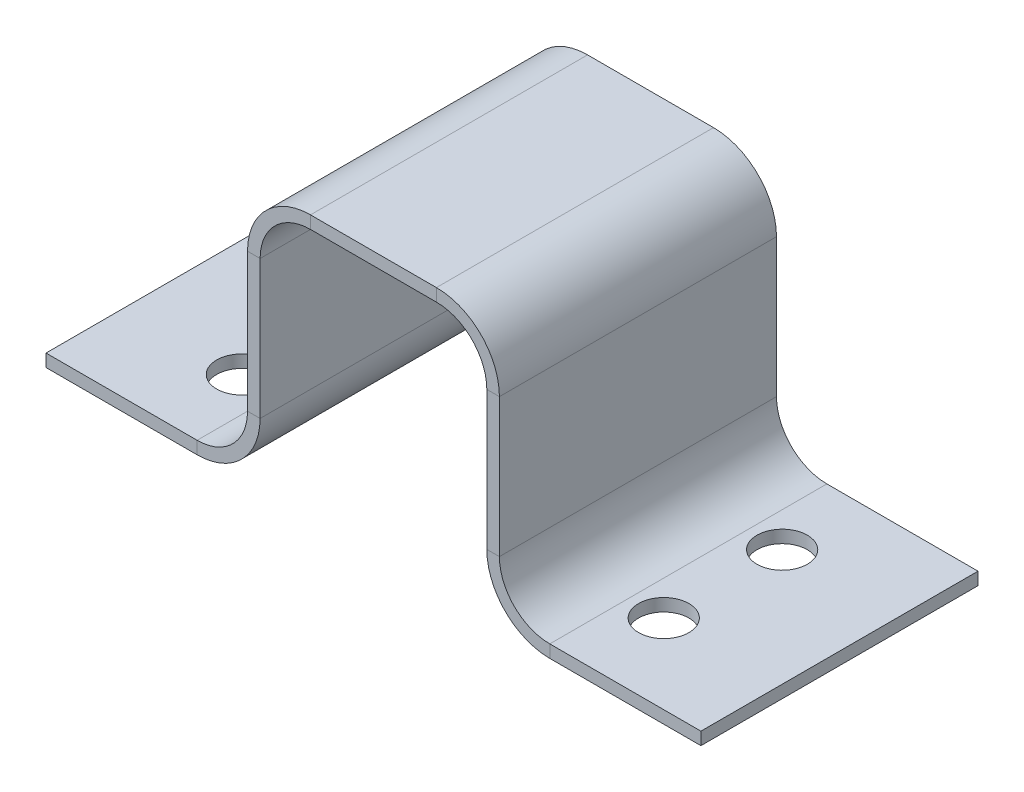
ISO-10303-21;
HEADER;
FILE_DESCRIPTION(('STEP AP214'),'2;1');
FILE_NAME('part.step','',(''),(''),'','','');
FILE_SCHEMA(('AUTOMOTIVE_DESIGN { 1 0 10303 214 1 1 1 1 }'));
ENDSEC;
DATA;
#1=APPLICATION_CONTEXT('core data for automotive mechanical design processes');
#2=APPLICATION_PROTOCOL_DEFINITION('international standard','automotive_design',2000,#1);
#3=PRODUCT_CONTEXT('',#1,'mechanical');
#4=PRODUCT('Part','Part','',(#3));
#5=PRODUCT_RELATED_PRODUCT_CATEGORY('part','',(#4));
#6=PRODUCT_DEFINITION_FORMATION('','',#4);
#7=PRODUCT_DEFINITION_CONTEXT('part definition',#1,'design');
#8=PRODUCT_DEFINITION('design','',#6,#7);
#9=PRODUCT_DEFINITION_SHAPE('','',#8);
#10=(LENGTH_UNIT() NAMED_UNIT(*) SI_UNIT(.MILLI.,.METRE.));
#11=(NAMED_UNIT(*) PLANE_ANGLE_UNIT() SI_UNIT($,.RADIAN.));
#12=(NAMED_UNIT(*) SI_UNIT($,.STERADIAN.) SOLID_ANGLE_UNIT());
#13=UNCERTAINTY_MEASURE_WITH_UNIT(LENGTH_MEASURE(1.E-05),#10,'distance_accuracy_value','');
#14=(GEOMETRIC_REPRESENTATION_CONTEXT(3) GLOBAL_UNCERTAINTY_ASSIGNED_CONTEXT((#13)) GLOBAL_UNIT_ASSIGNED_CONTEXT((#10,
#11,#12)) REPRESENTATION_CONTEXT('',''));
#15=CARTESIAN_POINT('',(0.,0.,0.));
#16=DIRECTION('',(0.,0.,1.));
#17=DIRECTION('',(1.,0.,0.));
#18=AXIS2_PLACEMENT_3D('',#15,#16,#17);
#19=CARTESIAN_POINT('',(-41.275,1.5875,17.4625));
#20=DIRECTION('',(-1.,0.,0.));
#21=DIRECTION('',(0.,0.,-1.));
#22=AXIS2_PLACEMENT_3D('',#19,#20,#21);
#23=PLANE('',#22);
#24=DIRECTION('',(0.,1.,0.));
#25=VECTOR('',#24,1.);
#26=CARTESIAN_POINT('',(-41.275,1.5875,-17.4625));
#27=LINE('',#26,#25);
#28=CARTESIAN_POINT('',(-41.275,0.,-17.4625));
#29=VERTEX_POINT('',#28);
#30=CARTESIAN_POINT('',(-41.275,1.5875,-17.4625));
#31=VERTEX_POINT('',#30);
#32=EDGE_CURVE('E11',#29,#31,#27,.T.);
#33=ORIENTED_EDGE('',*,*,#32,.F.);
#34=DIRECTION('',(0.,0.,-1.));
#35=VECTOR('',#34,1.);
#36=CARTESIAN_POINT('',(-41.275,0.,17.4625));
#37=LINE('',#36,#35);
#38=CARTESIAN_POINT('',(-41.275,0.,17.4625));
#39=VERTEX_POINT('',#38);
#40=EDGE_CURVE('E125',#39,#29,#37,.T.);
#41=ORIENTED_EDGE('',*,*,#40,.F.);
#42=DIRECTION('',(0.,1.,0.));
#43=VECTOR('',#42,1.);
#44=CARTESIAN_POINT('',(-41.275,1.5875,17.4625));
#45=LINE('',#44,#43);
#46=CARTESIAN_POINT('',(-41.275,1.5875,17.4625));
#47=VERTEX_POINT('',#46);
#48=EDGE_CURVE('E51',#39,#47,#45,.T.);
#49=ORIENTED_EDGE('',*,*,#48,.T.);
#50=DIRECTION('',(0.,0.,-1.));
#51=VECTOR('',#50,1.);
#52=CARTESIAN_POINT('',(-41.275,1.5875,17.4625));
#53=LINE('',#52,#51);
#54=EDGE_CURVE('E128',#47,#31,#53,.T.);
#55=ORIENTED_EDGE('',*,*,#54,.T.);
#56=EDGE_LOOP('',(#33,#41,#49,#55));
#57=FACE_BOUND('',#56,.T.);
#58=ADVANCED_FACE('F41',(#57),#23,.T.);
#59=CARTESIAN_POINT('',(-41.275,1.5875,17.4625));
#60=DIRECTION('',(0.,0.,1.));
#61=DIRECTION('',(-1.,0.,0.));
#62=AXIS2_PLACEMENT_3D('',#59,#60,#61);
#63=PLANE('',#62);
#64=ORIENTED_EDGE('',*,*,#48,.F.);
#65=DIRECTION('',(1.,0.,0.));
#66=VECTOR('',#65,1.);
#67=CARTESIAN_POINT('',(-41.275,0.,17.4625));
#68=LINE('',#67,#66);
#69=CARTESIAN_POINT('',(-22.225,0.,17.4625));
#70=VERTEX_POINT('',#69);
#71=EDGE_CURVE('E140',#70,#39,#68,.F.);
#72=ORIENTED_EDGE('',*,*,#71,.F.);
#73=DIRECTION('',(0.,1.,0.));
#74=VECTOR('',#73,1.);
#75=CARTESIAN_POINT('',(-22.225,1.5875,17.4625));
#76=LINE('',#75,#74);
#77=CARTESIAN_POINT('',(-22.225,1.5875,17.4625));
#78=VERTEX_POINT('',#77);
#79=EDGE_CURVE('E210',#70,#78,#76,.T.);
#80=ORIENTED_EDGE('',*,*,#79,.T.);
#81=DIRECTION('',(-1.,0.,0.));
#82=VECTOR('',#81,1.);
#83=CARTESIAN_POINT('',(-41.275,1.5875,17.4625));
#84=LINE('',#83,#82);
#85=EDGE_CURVE('E218',#78,#47,#84,.T.);
#86=ORIENTED_EDGE('',*,*,#85,.T.);
#87=EDGE_LOOP('',(#64,#72,#80,#86));
#88=FACE_BOUND('',#87,.T.);
#89=ADVANCED_FACE('F222',(#88),#63,.T.);
#90=CARTESIAN_POINT('',(-22.225,7.93749999999999,17.4625));
#91=DIRECTION('',(0.,0.,1.));
#92=DIRECTION('',(1.,0.,0.));
#93=AXIS2_PLACEMENT_3D('',#90,#91,#92);
#94=PLANE('',#93);
#95=ORIENTED_EDGE('',*,*,#79,.F.);
#96=CARTESIAN_POINT('',(-22.225,7.93749999999999,17.4625));
#97=DIRECTION('',(0.,0.,-1.));
#98=DIRECTION('',(-1.,0.,0.));
#99=AXIS2_PLACEMENT_3D('',#96,#97,#98);
#100=CIRCLE('',#99,7.9375);
#101=CARTESIAN_POINT('',(-14.2875,7.93749999999999,17.4625));
#102=VERTEX_POINT('',#101);
#103=EDGE_CURVE('E266',#102,#70,#100,.T.);
#104=ORIENTED_EDGE('',*,*,#103,.F.);
#105=DIRECTION('',(-1.,0.,0.));
#106=VECTOR('',#105,1.);
#107=CARTESIAN_POINT('',(-15.875,7.93749999999999,17.4625));
#108=LINE('',#107,#106);
#109=CARTESIAN_POINT('',(-15.875,7.93749999999999,17.4625));
#110=VERTEX_POINT('',#109);
#111=EDGE_CURVE('E207',#102,#110,#108,.T.);
#112=ORIENTED_EDGE('',*,*,#111,.T.);
#113=CARTESIAN_POINT('',(-22.225,7.93749999999999,17.4625));
#114=DIRECTION('',(0.,0.,-1.));
#115=DIRECTION('',(1.,0.,0.));
#116=AXIS2_PLACEMENT_3D('',#113,#114,#115);
#117=CIRCLE('',#116,6.35);
#118=EDGE_CURVE('E230',#110,#78,#117,.T.);
#119=ORIENTED_EDGE('',*,*,#118,.T.);
#120=EDGE_LOOP('',(#95,#104,#112,#119));
#121=FACE_BOUND('',#120,.T.);
#122=ADVANCED_FACE('F412',(#121),#94,.T.);
#123=CARTESIAN_POINT('',(-15.875,7.93749999999999,17.4625));
#124=DIRECTION('',(0.,0.,1.));
#125=DIRECTION('',(0.,-1.,0.));
#126=AXIS2_PLACEMENT_3D('',#123,#124,#125);
#127=PLANE('',#126);
#128=ORIENTED_EDGE('',*,*,#111,.F.);
#129=DIRECTION('',(0.,1.,0.));
#130=VECTOR('',#129,1.);
#131=CARTESIAN_POINT('',(-14.2875,7.93749999999999,17.4625));
#132=LINE('',#131,#130);
#133=CARTESIAN_POINT('',(-14.2875,25.4,17.4625));
#134=VERTEX_POINT('',#133);
#135=EDGE_CURVE('E238',#134,#102,#132,.F.);
#136=ORIENTED_EDGE('',*,*,#135,.F.);
#137=DIRECTION('',(-1.,0.,0.));
#138=VECTOR('',#137,1.);
#139=CARTESIAN_POINT('',(-15.875,25.4,17.4625));
#140=LINE('',#139,#138);
#141=CARTESIAN_POINT('',(-15.875,25.4,17.4625));
#142=VERTEX_POINT('',#141);
#143=EDGE_CURVE('E204',#134,#142,#140,.T.);
#144=ORIENTED_EDGE('',*,*,#143,.T.);
#145=DIRECTION('',(0.,-1.,0.));
#146=VECTOR('',#145,1.);
#147=CARTESIAN_POINT('',(-15.875,7.93749999999999,17.4625));
#148=LINE('',#147,#146);
#149=EDGE_CURVE('E346',#142,#110,#148,.T.);
#150=ORIENTED_EDGE('',*,*,#149,.T.);
#151=EDGE_LOOP('',(#128,#136,#144,#150));
#152=FACE_BOUND('',#151,.T.);
#153=ADVANCED_FACE('F545',(#152),#127,.T.);
#154=CARTESIAN_POINT('',(-7.93749999999999,25.4,17.4625));
#155=DIRECTION('',(0.,0.,-1.));
#156=DIRECTION('',(-1.,0.,0.));
#157=AXIS2_PLACEMENT_3D('',#154,#155,#156);
#158=PLANE('',#157);
#159=ORIENTED_EDGE('',*,*,#143,.F.);
#160=CARTESIAN_POINT('',(-7.93749999999999,25.4,17.4625));
#161=DIRECTION('',(0.,0.,-1.));
#162=DIRECTION('',(-1.,0.,0.));
#163=AXIS2_PLACEMENT_3D('',#160,#161,#162);
#164=CIRCLE('',#163,6.35);
#165=CARTESIAN_POINT('',(-7.93749999999999,31.75,17.4625));
#166=VERTEX_POINT('',#165);
#167=EDGE_CURVE('E158',#166,#134,#164,.F.);
#168=ORIENTED_EDGE('',*,*,#167,.F.);
#169=DIRECTION('',(0.,1.,0.));
#170=VECTOR('',#169,1.);
#171=CARTESIAN_POINT('',(-7.93749999999999,33.3375,17.4625));
#172=LINE('',#171,#170);
#173=CARTESIAN_POINT('',(-7.93749999999999,33.3375,17.4625));
#174=VERTEX_POINT('',#173);
#175=EDGE_CURVE('E201',#166,#174,#172,.T.);
#176=ORIENTED_EDGE('',*,*,#175,.T.);
#177=CARTESIAN_POINT('',(-7.93749999999999,25.4,17.4625));
#178=DIRECTION('',(0.,0.,1.));
#179=DIRECTION('',(-1.,0.,0.));
#180=AXIS2_PLACEMENT_3D('',#177,#178,#179);
#181=CIRCLE('',#180,7.9375);
#182=EDGE_CURVE('E355',#174,#142,#181,.T.);
#183=ORIENTED_EDGE('',*,*,#182,.T.);
#184=EDGE_LOOP('',(#159,#168,#176,#183));
#185=FACE_BOUND('',#184,.T.);
#186=ADVANCED_FACE('F542',(#185),#158,.F.);
#187=CARTESIAN_POINT('',(-7.93749999999999,33.3375,17.4625));
#188=DIRECTION('',(0.,0.,1.));
#189=DIRECTION('',(-1.,0.,0.));
#190=AXIS2_PLACEMENT_3D('',#187,#188,#189);
#191=PLANE('',#190);
#192=ORIENTED_EDGE('',*,*,#175,.F.);
#193=DIRECTION('',(1.,0.,0.));
#194=VECTOR('',#193,1.);
#195=CARTESIAN_POINT('',(-7.93749999999999,31.75,17.4625));
#196=LINE('',#195,#194);
#197=CARTESIAN_POINT('',(7.9375,31.75,17.4625));
#198=VERTEX_POINT('',#197);
#199=EDGE_CURVE('E247',#198,#166,#196,.F.);
#200=ORIENTED_EDGE('',*,*,#199,.F.);
#201=DIRECTION('',(0.,1.,0.));
#202=VECTOR('',#201,1.);
#203=CARTESIAN_POINT('',(7.9375,33.3375,17.4625));
#204=LINE('',#203,#202);
#205=CARTESIAN_POINT('',(7.9375,33.3375,17.4625));
#206=VERTEX_POINT('',#205);
#207=EDGE_CURVE('E198',#198,#206,#204,.T.);
#208=ORIENTED_EDGE('',*,*,#207,.T.);
#209=DIRECTION('',(-1.,0.,0.));
#210=VECTOR('',#209,1.);
#211=CARTESIAN_POINT('',(-7.93749999999999,33.3375,17.4625));
#212=LINE('',#211,#210);
#213=EDGE_CURVE('E315',#206,#174,#212,.T.);
#214=ORIENTED_EDGE('',*,*,#213,.T.);
#215=EDGE_LOOP('',(#192,#200,#208,#214));
#216=FACE_BOUND('',#215,.T.);
#217=ADVANCED_FACE('F540',(#216),#191,.T.);
#218=CARTESIAN_POINT('',(7.9375,25.4,17.4625));
#219=DIRECTION('',(0.,0.,-1.));
#220=DIRECTION('',(-1.,0.,0.));
#221=AXIS2_PLACEMENT_3D('',#218,#219,#220);
#222=PLANE('',#221);
#223=ORIENTED_EDGE('',*,*,#207,.F.);
#224=CARTESIAN_POINT('',(7.9375,25.4,17.4625));
#225=DIRECTION('',(0.,0.,-1.));
#226=DIRECTION('',(-1.,0.,0.));
#227=AXIS2_PLACEMENT_3D('',#224,#225,#226);
#228=CIRCLE('',#227,6.35);
#229=CARTESIAN_POINT('',(14.2875,25.4,17.4625));
#230=VERTEX_POINT('',#229);
#231=EDGE_CURVE('E269',#230,#198,#228,.F.);
#232=ORIENTED_EDGE('',*,*,#231,.F.);
#233=DIRECTION('',(1.,0.,0.));
#234=VECTOR('',#233,1.);
#235=CARTESIAN_POINT('',(15.875,25.4,17.4625));
#236=LINE('',#235,#234);
#237=CARTESIAN_POINT('',(15.875,25.4,17.4625));
#238=VERTEX_POINT('',#237);
#239=EDGE_CURVE('E195',#230,#238,#236,.T.);
#240=ORIENTED_EDGE('',*,*,#239,.T.);
#241=CARTESIAN_POINT('',(7.9375,25.4,17.4625));
#242=DIRECTION('',(0.,0.,1.));
#243=DIRECTION('',(-1.,0.,0.));
#244=AXIS2_PLACEMENT_3D('',#241,#242,#243);
#245=CIRCLE('',#244,7.9375);
#246=EDGE_CURVE('E337',#238,#206,#245,.T.);
#247=ORIENTED_EDGE('',*,*,#246,.T.);
#248=EDGE_LOOP('',(#223,#232,#240,#247));
#249=FACE_BOUND('',#248,.T.);
#250=ADVANCED_FACE('F528',(#249),#222,.F.);
#251=CARTESIAN_POINT('',(15.875,25.4,17.4625));
#252=DIRECTION('',(0.,0.,1.));
#253=DIRECTION('',(0.,1.,0.));
#254=AXIS2_PLACEMENT_3D('',#251,#252,#253);
#255=PLANE('',#254);
#256=ORIENTED_EDGE('',*,*,#239,.F.);
#257=DIRECTION('',(0.,-1.,0.));
#258=VECTOR('',#257,1.);
#259=CARTESIAN_POINT('',(14.2875,25.4,17.4625));
#260=LINE('',#259,#258);
#261=CARTESIAN_POINT('',(14.2875,7.9375,17.4625));
#262=VERTEX_POINT('',#261);
#263=EDGE_CURVE('E256',#262,#230,#260,.F.);
#264=ORIENTED_EDGE('',*,*,#263,.F.);
#265=DIRECTION('',(1.,0.,0.));
#266=VECTOR('',#265,1.);
#267=CARTESIAN_POINT('',(15.875,7.9375,17.4625));
#268=LINE('',#267,#266);
#269=CARTESIAN_POINT('',(15.875,7.9375,17.4625));
#270=VERTEX_POINT('',#269);
#271=EDGE_CURVE('E192',#262,#270,#268,.T.);
#272=ORIENTED_EDGE('',*,*,#271,.T.);
#273=DIRECTION('',(0.,1.,0.));
#274=VECTOR('',#273,1.);
#275=CARTESIAN_POINT('',(15.875,25.4,17.4625));
#276=LINE('',#275,#274);
#277=EDGE_CURVE('E328',#270,#238,#276,.T.);
#278=ORIENTED_EDGE('',*,*,#277,.T.);
#279=EDGE_LOOP('',(#256,#264,#272,#278));
#280=FACE_BOUND('',#279,.T.);
#281=ADVANCED_FACE('F605',(#280),#255,.T.);
#282=CARTESIAN_POINT('',(22.225,7.9375,17.4625));
#283=DIRECTION('',(0.,0.,1.));
#284=DIRECTION('',(1.,0.,0.));
#285=AXIS2_PLACEMENT_3D('',#282,#283,#284);
#286=PLANE('',#285);
#287=ORIENTED_EDGE('',*,*,#271,.F.);
#288=CARTESIAN_POINT('',(22.225,7.9375,17.4625));
#289=DIRECTION('',(0.,0.,-1.));
#290=DIRECTION('',(-1.,0.,0.));
#291=AXIS2_PLACEMENT_3D('',#288,#289,#290);
#292=CIRCLE('',#291,7.9375);
#293=CARTESIAN_POINT('',(22.225,0.,17.4625));
#294=VERTEX_POINT('',#293);
#295=EDGE_CURVE('E152',#294,#262,#292,.T.);
#296=ORIENTED_EDGE('',*,*,#295,.F.);
#297=DIRECTION('',(0.,1.,0.));
#298=VECTOR('',#297,1.);
#299=CARTESIAN_POINT('',(22.225,1.5875,17.4625));
#300=LINE('',#299,#298);
#301=CARTESIAN_POINT('',(22.225,1.5875,17.4625));
#302=VERTEX_POINT('',#301);
#303=EDGE_CURVE('E189',#294,#302,#300,.T.);
#304=ORIENTED_EDGE('',*,*,#303,.T.);
#305=CARTESIAN_POINT('',(22.225,7.9375,17.4625));
#306=DIRECTION('',(0.,0.,-1.));
#307=DIRECTION('',(1.,0.,0.));
#308=AXIS2_PLACEMENT_3D('',#305,#306,#307);
#309=CIRCLE('',#308,6.35);
#310=EDGE_CURVE('E379',#302,#270,#309,.T.);
#311=ORIENTED_EDGE('',*,*,#310,.T.);
#312=EDGE_LOOP('',(#287,#296,#304,#311));
#313=FACE_BOUND('',#312,.T.);
#314=ADVANCED_FACE('F602',(#313),#286,.T.);
#315=CARTESIAN_POINT('',(22.225,1.5875,17.4625));
#316=DIRECTION('',(0.,0.,1.));
#317=DIRECTION('',(-1.,0.,0.));
#318=AXIS2_PLACEMENT_3D('',#315,#316,#317);
#319=PLANE('',#318);
#320=ORIENTED_EDGE('',*,*,#303,.F.);
#321=DIRECTION('',(1.,0.,0.));
#322=VECTOR('',#321,1.);
#323=CARTESIAN_POINT('',(22.225,0.,17.4625));
#324=LINE('',#323,#322);
#325=CARTESIAN_POINT('',(41.275,0.,17.4625));
#326=VERTEX_POINT('',#325);
#327=EDGE_CURVE('E264',#326,#294,#324,.F.);
#328=ORIENTED_EDGE('',*,*,#327,.F.);
#329=DIRECTION('',(0.,1.,0.));
#330=VECTOR('',#329,1.);
#331=CARTESIAN_POINT('',(41.275,1.5875,17.4625));
#332=LINE('',#331,#330);
#333=CARTESIAN_POINT('',(41.275,1.5875,17.4625));
#334=VERTEX_POINT('',#333);
#335=EDGE_CURVE('E186',#326,#334,#332,.T.);
#336=ORIENTED_EDGE('',*,*,#335,.T.);
#337=DIRECTION('',(-1.,0.,0.));
#338=VECTOR('',#337,1.);
#339=CARTESIAN_POINT('',(22.225,1.5875,17.4625));
#340=LINE('',#339,#338);
#341=EDGE_CURVE('E370',#334,#302,#340,.T.);
#342=ORIENTED_EDGE('',*,*,#341,.T.);
#343=EDGE_LOOP('',(#320,#328,#336,#342));
#344=FACE_BOUND('',#343,.T.);
#345=ADVANCED_FACE('F459',(#344),#319,.T.);
#346=CARTESIAN_POINT('',(41.275,1.5875,17.4625));
#347=DIRECTION('',(-1.,0.,0.));
#348=DIRECTION('',(0.,0.,-1.));
#349=AXIS2_PLACEMENT_3D('',#346,#347,#348);
#350=PLANE('',#349);
#351=ORIENTED_EDGE('',*,*,#335,.F.);
#352=DIRECTION('',(0.,0.,1.));
#353=VECTOR('',#352,1.);
#354=CARTESIAN_POINT('',(41.275,0.,17.4625));
#355=LINE('',#354,#353);
#356=CARTESIAN_POINT('',(41.275,0.,-17.4625));
#357=VERTEX_POINT('',#356);
#358=EDGE_CURVE('E281',#326,#357,#355,.F.);
#359=ORIENTED_EDGE('',*,*,#358,.T.);
#360=DIRECTION('',(0.,1.,0.));
#361=VECTOR('',#360,1.);
#362=CARTESIAN_POINT('',(41.275,1.5875,-17.4625));
#363=LINE('',#362,#361);
#364=CARTESIAN_POINT('',(41.275,1.5875,-17.4625));
#365=VERTEX_POINT('',#364);
#366=EDGE_CURVE('E183',#357,#365,#363,.T.);
#367=ORIENTED_EDGE('',*,*,#366,.T.);
#368=DIRECTION('',(0.,0.,-1.));
#369=VECTOR('',#368,1.);
#370=CARTESIAN_POINT('',(41.275,1.5875,17.4625));
#371=LINE('',#370,#369);
#372=EDGE_CURVE('E373',#334,#365,#371,.T.);
#373=ORIENTED_EDGE('',*,*,#372,.F.);
#374=EDGE_LOOP('',(#351,#359,#367,#373));
#375=FACE_BOUND('',#374,.T.);
#376=ADVANCED_FACE('F453',(#375),#350,.F.);
#377=CARTESIAN_POINT('',(22.225,1.5875,-17.4625));
#378=DIRECTION('',(0.,0.,1.));
#379=DIRECTION('',(-1.,0.,0.));
#380=AXIS2_PLACEMENT_3D('',#377,#378,#379);
#381=PLANE('',#380);
#382=ORIENTED_EDGE('',*,*,#366,.F.);
#383=DIRECTION('',(1.,0.,0.));
#384=VECTOR('',#383,1.);
#385=CARTESIAN_POINT('',(22.225,0.,-17.4625));
#386=LINE('',#385,#384);
#387=CARTESIAN_POINT('',(22.225,0.,-17.4625));
#388=VERTEX_POINT('',#387);
#389=EDGE_CURVE('E161',#357,#388,#386,.F.);
#390=ORIENTED_EDGE('',*,*,#389,.T.);
#391=DIRECTION('',(0.,1.,0.));
#392=VECTOR('',#391,1.);
#393=CARTESIAN_POINT('',(22.225,1.5875,-17.4625));
#394=LINE('',#393,#392);
#395=CARTESIAN_POINT('',(22.225,1.5875,-17.4625));
#396=VERTEX_POINT('',#395);
#397=EDGE_CURVE('E180',#388,#396,#394,.T.);
#398=ORIENTED_EDGE('',*,*,#397,.T.);
#399=DIRECTION('',(-1.,0.,0.));
#400=VECTOR('',#399,1.);
#401=CARTESIAN_POINT('',(22.225,1.5875,-17.4625));
#402=LINE('',#401,#400);
#403=EDGE_CURVE('E364',#365,#396,#402,.T.);
#404=ORIENTED_EDGE('',*,*,#403,.F.);
#405=EDGE_LOOP('',(#382,#390,#398,#404));
#406=FACE_BOUND('',#405,.T.);
#407=ADVANCED_FACE('F594',(#406),#381,.F.);
#408=CARTESIAN_POINT('',(22.225,7.9375,-17.4625));
#409=DIRECTION('',(0.,0.,1.));
#410=DIRECTION('',(1.,0.,0.));
#411=AXIS2_PLACEMENT_3D('',#408,#409,#410);
#412=PLANE('',#411);
#413=ORIENTED_EDGE('',*,*,#397,.F.);
#414=CARTESIAN_POINT('',(22.225,7.9375,-17.4625));
#415=DIRECTION('',(0.,0.,-1.));
#416=DIRECTION('',(-1.,0.,0.));
#417=AXIS2_PLACEMENT_3D('',#414,#415,#416);
#418=CIRCLE('',#417,7.9375);
#419=CARTESIAN_POINT('',(14.2875,7.9375,-17.4625));
#420=VERTEX_POINT('',#419);
#421=EDGE_CURVE('E278',#388,#420,#418,.T.);
#422=ORIENTED_EDGE('',*,*,#421,.T.);
#423=DIRECTION('',(1.,0.,0.));
#424=VECTOR('',#423,1.);
#425=CARTESIAN_POINT('',(15.875,7.9375,-17.4625));
#426=LINE('',#425,#424);
#427=CARTESIAN_POINT('',(15.875,7.9375,-17.4625));
#428=VERTEX_POINT('',#427);
#429=EDGE_CURVE('E177',#420,#428,#426,.T.);
#430=ORIENTED_EDGE('',*,*,#429,.T.);
#431=CARTESIAN_POINT('',(22.225,7.9375,-17.4625));
#432=DIRECTION('',(0.,0.,-1.));
#433=DIRECTION('',(1.,0.,0.));
#434=AXIS2_PLACEMENT_3D('',#431,#432,#433);
#435=CIRCLE('',#434,6.35);
#436=EDGE_CURVE('E376',#396,#428,#435,.T.);
#437=ORIENTED_EDGE('',*,*,#436,.F.);
#438=EDGE_LOOP('',(#413,#422,#430,#437));
#439=FACE_BOUND('',#438,.T.);
#440=ADVANCED_FACE('F590',(#439),#412,.F.);
#441=CARTESIAN_POINT('',(15.875,25.4,-17.4625));
#442=DIRECTION('',(0.,0.,1.));
#443=DIRECTION('',(0.,1.,0.));
#444=AXIS2_PLACEMENT_3D('',#441,#442,#443);
#445=PLANE('',#444);
#446=ORIENTED_EDGE('',*,*,#429,.F.);
#447=DIRECTION('',(0.,-1.,0.));
#448=VECTOR('',#447,1.);
#449=CARTESIAN_POINT('',(14.2875,25.4,-17.4625));
#450=LINE('',#449,#448);
#451=CARTESIAN_POINT('',(14.2875,25.4,-17.4625));
#452=VERTEX_POINT('',#451);
#453=EDGE_CURVE('E252',#420,#452,#450,.F.);
#454=ORIENTED_EDGE('',*,*,#453,.T.);
#455=DIRECTION('',(1.,0.,0.));
#456=VECTOR('',#455,1.);
#457=CARTESIAN_POINT('',(15.875,25.4,-17.4625));
#458=LINE('',#457,#456);
#459=CARTESIAN_POINT('',(15.875,25.4,-17.4625));
#460=VERTEX_POINT('',#459);
#461=EDGE_CURVE('E174',#452,#460,#458,.T.);
#462=ORIENTED_EDGE('',*,*,#461,.T.);
#463=DIRECTION('',(0.,1.,0.));
#464=VECTOR('',#463,1.);
#465=CARTESIAN_POINT('',(15.875,25.4,-17.4625));
#466=LINE('',#465,#464);
#467=EDGE_CURVE('E322',#428,#460,#466,.T.);
#468=ORIENTED_EDGE('',*,*,#467,.F.);
#469=EDGE_LOOP('',(#446,#454,#462,#468));
#470=FACE_BOUND('',#469,.T.);
#471=ADVANCED_FACE('F587',(#470),#445,.F.);
#472=CARTESIAN_POINT('',(7.9375,25.4,-17.4625));
#473=DIRECTION('',(0.,0.,-1.));
#474=DIRECTION('',(-1.,0.,0.));
#475=AXIS2_PLACEMENT_3D('',#472,#473,#474);
#476=PLANE('',#475);
#477=ORIENTED_EDGE('',*,*,#461,.F.);
#478=CARTESIAN_POINT('',(7.9375,25.4,-17.4625));
#479=DIRECTION('',(0.,0.,-1.));
#480=DIRECTION('',(-1.,0.,0.));
#481=AXIS2_PLACEMENT_3D('',#478,#479,#480);
#482=CIRCLE('',#481,6.35);
#483=CARTESIAN_POINT('',(7.9375,31.75,-17.4625));
#484=VERTEX_POINT('',#483);
#485=EDGE_CURVE('E260',#452,#484,#482,.F.);
#486=ORIENTED_EDGE('',*,*,#485,.T.);
#487=DIRECTION('',(0.,1.,0.));
#488=VECTOR('',#487,1.);
#489=CARTESIAN_POINT('',(7.9375,33.3375,-17.4625));
#490=LINE('',#489,#488);
#491=CARTESIAN_POINT('',(7.9375,33.3375,-17.4625));
#492=VERTEX_POINT('',#491);
#493=EDGE_CURVE('E171',#484,#492,#490,.T.);
#494=ORIENTED_EDGE('',*,*,#493,.T.);
#495=CARTESIAN_POINT('',(7.9375,25.4,-17.4625));
#496=DIRECTION('',(0.,0.,1.));
#497=DIRECTION('',(-1.,0.,0.));
#498=AXIS2_PLACEMENT_3D('',#495,#496,#497);
#499=CIRCLE('',#498,7.9375);
#500=EDGE_CURVE('E334',#460,#492,#499,.T.);
#501=ORIENTED_EDGE('',*,*,#500,.F.);
#502=EDGE_LOOP('',(#477,#486,#494,#501));
#503=FACE_BOUND('',#502,.T.);
#504=ADVANCED_FACE('F535',(#503),#476,.T.);
#505=CARTESIAN_POINT('',(-7.93749999999999,33.3375,-17.4625));
#506=DIRECTION('',(0.,0.,1.));
#507=DIRECTION('',(-1.,0.,0.));
#508=AXIS2_PLACEMENT_3D('',#505,#506,#507);
#509=PLANE('',#508);
#510=ORIENTED_EDGE('',*,*,#493,.F.);
#511=DIRECTION('',(1.,0.,0.));
#512=VECTOR('',#511,1.);
#513=CARTESIAN_POINT('',(-7.93749999999999,31.75,-17.4625));
#514=LINE('',#513,#512);
#515=CARTESIAN_POINT('',(-7.93749999999999,31.75,-17.4625));
#516=VERTEX_POINT('',#515);
#517=EDGE_CURVE('E248',#484,#516,#514,.F.);
#518=ORIENTED_EDGE('',*,*,#517,.T.);
#519=DIRECTION('',(0.,1.,0.));
#520=VECTOR('',#519,1.);
#521=CARTESIAN_POINT('',(-7.93749999999999,33.3375,-17.4625));
#522=LINE('',#521,#520);
#523=CARTESIAN_POINT('',(-7.93749999999999,33.3375,-17.4625));
#524=VERTEX_POINT('',#523);
#525=EDGE_CURVE('E168',#516,#524,#522,.T.);
#526=ORIENTED_EDGE('',*,*,#525,.T.);
#527=DIRECTION('',(-1.,0.,0.));
#528=VECTOR('',#527,1.);
#529=CARTESIAN_POINT('',(-7.93749999999999,33.3375,-17.4625));
#530=LINE('',#529,#528);
#531=EDGE_CURVE('E301',#492,#524,#530,.T.);
#532=ORIENTED_EDGE('',*,*,#531,.F.);
#533=EDGE_LOOP('',(#510,#518,#526,#532));
#534=FACE_BOUND('',#533,.T.);
#535=ADVANCED_FACE('F498',(#534),#509,.F.);
#536=CARTESIAN_POINT('',(-7.93749999999999,25.4,-17.4625));
#537=DIRECTION('',(0.,0.,-1.));
#538=DIRECTION('',(-1.,0.,0.));
#539=AXIS2_PLACEMENT_3D('',#536,#537,#538);
#540=PLANE('',#539);
#541=ORIENTED_EDGE('',*,*,#525,.F.);
#542=CARTESIAN_POINT('',(-7.93749999999999,25.4,-17.4625));
#543=DIRECTION('',(0.,0.,-1.));
#544=DIRECTION('',(-1.,0.,0.));
#545=AXIS2_PLACEMENT_3D('',#542,#543,#544);
#546=CIRCLE('',#545,6.35);
#547=CARTESIAN_POINT('',(-14.2875,25.4,-17.4625));
#548=VERTEX_POINT('',#547);
#549=EDGE_CURVE('E243',#516,#548,#546,.F.);
#550=ORIENTED_EDGE('',*,*,#549,.T.);
#551=DIRECTION('',(-1.,0.,0.));
#552=VECTOR('',#551,1.);
#553=CARTESIAN_POINT('',(-15.875,25.4,-17.4625));
#554=LINE('',#553,#552);
#555=CARTESIAN_POINT('',(-15.875,25.4,-17.4625));
#556=VERTEX_POINT('',#555);
#557=EDGE_CURVE('E165',#548,#556,#554,.T.);
#558=ORIENTED_EDGE('',*,*,#557,.T.);
#559=CARTESIAN_POINT('',(-7.93749999999999,25.4,-17.4625));
#560=DIRECTION('',(0.,0.,1.));
#561=DIRECTION('',(-1.,0.,0.));
#562=AXIS2_PLACEMENT_3D('',#559,#560,#561);
#563=CIRCLE('',#562,7.9375);
#564=EDGE_CURVE('E352',#524,#556,#563,.T.);
#565=ORIENTED_EDGE('',*,*,#564,.F.);
#566=EDGE_LOOP('',(#541,#550,#558,#565));
#567=FACE_BOUND('',#566,.T.);
#568=ADVANCED_FACE('F501',(#567),#540,.T.);
#569=CARTESIAN_POINT('',(-15.875,7.93749999999999,-17.4625));
#570=DIRECTION('',(0.,0.,1.));
#571=DIRECTION('',(0.,-1.,0.));
#572=AXIS2_PLACEMENT_3D('',#569,#570,#571);
#573=PLANE('',#572);
#574=ORIENTED_EDGE('',*,*,#557,.F.);
#575=DIRECTION('',(0.,1.,0.));
#576=VECTOR('',#575,1.);
#577=CARTESIAN_POINT('',(-14.2875,7.93749999999999,-17.4625));
#578=LINE('',#577,#576);
#579=CARTESIAN_POINT('',(-14.2875,7.93749999999999,-17.4625));
#580=VERTEX_POINT('',#579);
#581=EDGE_CURVE('E239',#548,#580,#578,.F.);
#582=ORIENTED_EDGE('',*,*,#581,.T.);
#583=DIRECTION('',(-1.,0.,0.));
#584=VECTOR('',#583,1.);
#585=CARTESIAN_POINT('',(-15.875,7.93749999999999,-17.4625));
#586=LINE('',#585,#584);
#587=CARTESIAN_POINT('',(-15.875,7.93749999999999,-17.4625));
#588=VERTEX_POINT('',#587);
#589=EDGE_CURVE('E162',#580,#588,#586,.T.);
#590=ORIENTED_EDGE('',*,*,#589,.T.);
#591=DIRECTION('',(0.,-1.,0.));
#592=VECTOR('',#591,1.);
#593=CARTESIAN_POINT('',(-15.875,7.93749999999999,-17.4625));
#594=LINE('',#593,#592);
#595=EDGE_CURVE('E340',#556,#588,#594,.T.);
#596=ORIENTED_EDGE('',*,*,#595,.F.);
#597=EDGE_LOOP('',(#574,#582,#590,#596));
#598=FACE_BOUND('',#597,.T.);
#599=ADVANCED_FACE('F432',(#598),#573,.F.);
#600=CARTESIAN_POINT('',(-22.225,7.93749999999999,-17.4625));
#601=DIRECTION('',(0.,0.,1.));
#602=DIRECTION('',(1.,0.,0.));
#603=AXIS2_PLACEMENT_3D('',#600,#601,#602);
#604=PLANE('',#603);
#605=ORIENTED_EDGE('',*,*,#589,.F.);
#606=CARTESIAN_POINT('',(-22.225,7.93749999999999,-17.4625));
#607=DIRECTION('',(0.,0.,-1.));
#608=DIRECTION('',(-1.,0.,0.));
#609=AXIS2_PLACEMENT_3D('',#606,#607,#608);
#610=CIRCLE('',#609,7.9375);
#611=CARTESIAN_POINT('',(-22.225,0.,-17.4625));
#612=VERTEX_POINT('',#611);
#613=EDGE_CURVE('E234',#580,#612,#610,.T.);
#614=ORIENTED_EDGE('',*,*,#613,.T.);
#615=DIRECTION('',(0.,1.,0.));
#616=VECTOR('',#615,1.);
#617=CARTESIAN_POINT('',(-22.225,1.5875,-17.4625));
#618=LINE('',#617,#616);
#619=CARTESIAN_POINT('',(-22.225,1.5875,-17.4625));
#620=VERTEX_POINT('',#619);
#621=EDGE_CURVE('E45',#612,#620,#618,.T.);
#622=ORIENTED_EDGE('',*,*,#621,.T.);
#623=CARTESIAN_POINT('',(-22.225,7.93749999999999,-17.4625));
#624=DIRECTION('',(0.,0.,-1.));
#625=DIRECTION('',(1.,0.,0.));
#626=AXIS2_PLACEMENT_3D('',#623,#624,#625);
#627=CIRCLE('',#626,6.35);
#628=EDGE_CURVE('E225',#588,#620,#627,.T.);
#629=ORIENTED_EDGE('',*,*,#628,.F.);
#630=EDGE_LOOP('',(#605,#614,#622,#629));
#631=FACE_BOUND('',#630,.T.);
#632=ADVANCED_FACE('F425',(#631),#604,.F.);
#633=CARTESIAN_POINT('',(26.590625,1.5875,-7.46125));
#634=DIRECTION('',(0.,-1.,0.));
#635=DIRECTION('',(1.,0.,0.));
#636=AXIS2_PLACEMENT_3D('',#633,#634,#635);
#637=CYLINDRICAL_SURFACE('',#636,3.175);
#638=CARTESIAN_POINT('',(26.590625,1.5875,-7.46125));
#639=DIRECTION('',(0.,1.,0.));
#640=DIRECTION('',(0.,0.,1.));
#641=AXIS2_PLACEMENT_3D('',#638,#639,#640);
#642=CIRCLE('',#641,3.175);
#643=CARTESIAN_POINT('',(26.590625,1.5875,-4.28625));
#644=VERTEX_POINT('',#643);
#645=EDGE_CURVE('E358',#644,#644,#642,.T.);
#646=ORIENTED_EDGE('',*,*,#645,.T.);
#647=EDGE_LOOP('',(#646));
#648=FACE_BOUND('',#647,.T.);
#649=CARTESIAN_POINT('',(26.590625,0.,-7.46125));
#650=DIRECTION('',(0.,1.,0.));
#651=DIRECTION('',(0.,0.,1.));
#652=AXIS2_PLACEMENT_3D('',#649,#650,#651);
#653=CIRCLE('',#652,3.175);
#654=CARTESIAN_POINT('',(26.590625,0.,-4.28625));
#655=VERTEX_POINT('',#654);
#656=EDGE_CURVE('E154',#655,#655,#653,.T.);
#657=ORIENTED_EDGE('',*,*,#656,.F.);
#658=EDGE_LOOP('',(#657));
#659=FACE_BOUND('',#658,.T.);
#660=ADVANCED_FACE('F423',(#648,#659),#637,.F.);
#661=CARTESIAN_POINT('',(26.590625,1.5875,7.46125));
#662=DIRECTION('',(0.,-1.,0.));
#663=DIRECTION('',(1.,0.,0.));
#664=AXIS2_PLACEMENT_3D('',#661,#662,#663);
#665=CYLINDRICAL_SURFACE('',#664,3.175);
#666=CARTESIAN_POINT('',(26.590625,1.5875,7.46125));
#667=DIRECTION('',(0.,1.,0.));
#668=DIRECTION('',(0.,0.,1.));
#669=AXIS2_PLACEMENT_3D('',#666,#667,#668);
#670=CIRCLE('',#669,3.175);
#671=CARTESIAN_POINT('',(26.590625,1.5875,10.63625));
#672=VERTEX_POINT('',#671);
#673=EDGE_CURVE('E361',#672,#672,#670,.T.);
#674=ORIENTED_EDGE('',*,*,#673,.T.);
#675=EDGE_LOOP('',(#674));
#676=FACE_BOUND('',#675,.T.);
#677=CARTESIAN_POINT('',(26.590625,0.,7.46125));
#678=DIRECTION('',(0.,1.,0.));
#679=DIRECTION('',(0.,0.,1.));
#680=AXIS2_PLACEMENT_3D('',#677,#678,#679);
#681=CIRCLE('',#680,3.175);
#682=CARTESIAN_POINT('',(26.590625,0.,10.63625));
#683=VERTEX_POINT('',#682);
#684=EDGE_CURVE('E157',#683,#683,#681,.T.);
#685=ORIENTED_EDGE('',*,*,#684,.F.);
#686=EDGE_LOOP('',(#685));
#687=FACE_BOUND('',#686,.T.);
#688=ADVANCED_FACE('F43',(#676,#687),#665,.F.);
#689=CARTESIAN_POINT('',(-26.590625,1.5875,7.46125));
#690=DIRECTION('',(0.,-1.,0.));
#691=DIRECTION('',(0.,0.,-1.));
#692=AXIS2_PLACEMENT_3D('',#689,#690,#691);
#693=CYLINDRICAL_SURFACE('',#692,3.175);
#694=CARTESIAN_POINT('',(-26.590625,1.5875,7.46125));
#695=DIRECTION('',(0.,1.,0.));
#696=DIRECTION('',(0.,0.,1.));
#697=AXIS2_PLACEMENT_3D('',#694,#695,#696);
#698=CIRCLE('',#697,3.175);
#699=CARTESIAN_POINT('',(-26.590625,1.5875,10.63625));
#700=VERTEX_POINT('',#699);
#701=EDGE_CURVE('E382',#700,#700,#698,.T.);
#702=ORIENTED_EDGE('',*,*,#701,.T.);
#703=EDGE_LOOP('',(#702));
#704=FACE_BOUND('',#703,.T.);
#705=CARTESIAN_POINT('',(-26.590625,0.,7.46125));
#706=DIRECTION('',(0.,1.,0.));
#707=DIRECTION('',(0.,0.,1.));
#708=AXIS2_PLACEMENT_3D('',#705,#706,#707);
#709=CIRCLE('',#708,3.175);
#710=CARTESIAN_POINT('',(-26.590625,0.,10.63625));
#711=VERTEX_POINT('',#710);
#712=EDGE_CURVE('E147',#711,#711,#709,.T.);
#713=ORIENTED_EDGE('',*,*,#712,.F.);
#714=EDGE_LOOP('',(#713));
#715=FACE_BOUND('',#714,.T.);
#716=ADVANCED_FACE('F418',(#704,#715),#693,.F.);
#717=CARTESIAN_POINT('',(-26.590625,1.5875,-7.46125));
#718=DIRECTION('',(0.,-1.,0.));
#719=DIRECTION('',(0.,0.,-1.));
#720=AXIS2_PLACEMENT_3D('',#717,#718,#719);
#721=CYLINDRICAL_SURFACE('',#720,3.175);
#722=CARTESIAN_POINT('',(-26.590625,1.5875,-7.46125));
#723=DIRECTION('',(0.,1.,0.));
#724=DIRECTION('',(0.,0.,1.));
#725=AXIS2_PLACEMENT_3D('',#722,#723,#724);
#726=CIRCLE('',#725,3.175);
#727=CARTESIAN_POINT('',(-26.590625,1.5875,-4.28625));
#728=VERTEX_POINT('',#727);
#729=EDGE_CURVE('E385',#728,#728,#726,.T.);
#730=ORIENTED_EDGE('',*,*,#729,.T.);
#731=EDGE_LOOP('',(#730));
#732=FACE_BOUND('',#731,.T.);
#733=CARTESIAN_POINT('',(-26.590625,0.,-7.46125));
#734=DIRECTION('',(0.,1.,0.));
#735=DIRECTION('',(0.,0.,1.));
#736=AXIS2_PLACEMENT_3D('',#733,#734,#735);
#737=CIRCLE('',#736,3.175);
#738=CARTESIAN_POINT('',(-26.590625,0.,-4.28625));
#739=VERTEX_POINT('',#738);
#740=EDGE_CURVE('E144',#739,#739,#737,.T.);
#741=ORIENTED_EDGE('',*,*,#740,.F.);
#742=EDGE_LOOP('',(#741));
#743=FACE_BOUND('',#742,.T.);
#744=ADVANCED_FACE('F389',(#732,#743),#721,.F.);
#745=CARTESIAN_POINT('',(-41.275,1.5875,-17.4625));
#746=DIRECTION('',(0.,0.,1.));
#747=DIRECTION('',(-1.,0.,0.));
#748=AXIS2_PLACEMENT_3D('',#745,#746,#747);
#749=PLANE('',#748);
#750=DIRECTION('',(1.,0.,0.));
#751=VECTOR('',#750,1.);
#752=CARTESIAN_POINT('',(-41.275,0.,-17.4625));
#753=LINE('',#752,#751);
#754=EDGE_CURVE('E138',#612,#29,#753,.F.);
#755=ORIENTED_EDGE('',*,*,#754,.T.);
#756=ORIENTED_EDGE('',*,*,#32,.T.);
#757=DIRECTION('',(-1.,0.,0.));
#758=VECTOR('',#757,1.);
#759=CARTESIAN_POINT('',(-41.275,1.5875,-17.4625));
#760=LINE('',#759,#758);
#761=EDGE_CURVE('E220',#620,#31,#760,.T.);
#762=ORIENTED_EDGE('',*,*,#761,.F.);
#763=ORIENTED_EDGE('',*,*,#621,.F.);
#764=EDGE_LOOP('',(#755,#756,#762,#763));
#765=FACE_BOUND('',#764,.T.);
#766=ADVANCED_FACE('F142',(#765),#749,.F.);
#767=CARTESIAN_POINT('',(-22.225,7.93749999999999,17.4625));
#768=DIRECTION('',(0.,0.,-1.));
#769=DIRECTION('',(-1.,0.,0.));
#770=AXIS2_PLACEMENT_3D('',#767,#768,#769);
#771=CYLINDRICAL_SURFACE('',#770,6.35);
#772=ORIENTED_EDGE('',*,*,#628,.T.);
#773=DIRECTION('',(0.,0.,-1.));
#774=VECTOR('',#773,1.);
#775=CARTESIAN_POINT('',(-22.225,1.5875,17.4625));
#776=LINE('',#775,#774);
#777=EDGE_CURVE('E223',#78,#620,#776,.T.);
#778=ORIENTED_EDGE('',*,*,#777,.F.);
#779=ORIENTED_EDGE('',*,*,#118,.F.);
#780=DIRECTION('',(0.,0.,-1.));
#781=VECTOR('',#780,1.);
#782=CARTESIAN_POINT('',(-15.875,7.93749999999999,17.4625));
#783=LINE('',#782,#781);
#784=EDGE_CURVE('E343',#110,#588,#783,.T.);
#785=ORIENTED_EDGE('',*,*,#784,.T.);
#786=EDGE_LOOP('',(#772,#778,#779,#785));
#787=FACE_BOUND('',#786,.T.);
#788=ADVANCED_FACE('F394',(#787),#771,.F.);
#789=CARTESIAN_POINT('',(-41.275,1.5875,17.4625));
#790=DIRECTION('',(0.,-1.,0.));
#791=DIRECTION('',(0.,0.,-1.));
#792=AXIS2_PLACEMENT_3D('',#789,#790,#791);
#793=PLANE('',#792);
#794=ORIENTED_EDGE('',*,*,#701,.F.);
#795=EDGE_LOOP('',(#794));
#796=FACE_BOUND('',#795,.T.);
#797=ORIENTED_EDGE('',*,*,#729,.F.);
#798=EDGE_LOOP('',(#797));
#799=FACE_BOUND('',#798,.T.);
#800=ORIENTED_EDGE('',*,*,#761,.T.);
#801=ORIENTED_EDGE('',*,*,#54,.F.);
#802=ORIENTED_EDGE('',*,*,#85,.F.);
#803=ORIENTED_EDGE('',*,*,#777,.T.);
#804=EDGE_LOOP('',(#800,#801,#802,#803));
#805=FACE_BOUND('',#804,.T.);
#806=ADVANCED_FACE('F216',(#796,#799,#805),#793,.F.);
#807=CARTESIAN_POINT('',(22.225,7.9375,17.4625));
#808=DIRECTION('',(0.,0.,-1.));
#809=DIRECTION('',(-1.,0.,0.));
#810=AXIS2_PLACEMENT_3D('',#807,#808,#809);
#811=CYLINDRICAL_SURFACE('',#810,6.35);
#812=ORIENTED_EDGE('',*,*,#436,.T.);
#813=DIRECTION('',(0.,0.,-1.));
#814=VECTOR('',#813,1.);
#815=CARTESIAN_POINT('',(15.875,7.9375,17.4625));
#816=LINE('',#815,#814);
#817=EDGE_CURVE('E331',#270,#428,#816,.T.);
#818=ORIENTED_EDGE('',*,*,#817,.F.);
#819=ORIENTED_EDGE('',*,*,#310,.F.);
#820=DIRECTION('',(0.,0.,-1.));
#821=VECTOR('',#820,1.);
#822=CARTESIAN_POINT('',(22.225,1.5875,17.4625));
#823=LINE('',#822,#821);
#824=EDGE_CURVE('E367',#302,#396,#823,.T.);
#825=ORIENTED_EDGE('',*,*,#824,.T.);
#826=EDGE_LOOP('',(#812,#818,#819,#825));
#827=FACE_BOUND('',#826,.T.);
#828=ADVANCED_FACE('F393',(#827),#811,.F.);
#829=CARTESIAN_POINT('',(22.225,1.5875,17.4625));
#830=DIRECTION('',(0.,-1.,0.));
#831=DIRECTION('',(1.,0.,0.));
#832=AXIS2_PLACEMENT_3D('',#829,#830,#831);
#833=PLANE('',#832);
#834=ORIENTED_EDGE('',*,*,#645,.F.);
#835=EDGE_LOOP('',(#834));
#836=FACE_BOUND('',#835,.T.);
#837=ORIENTED_EDGE('',*,*,#673,.F.);
#838=EDGE_LOOP('',(#837));
#839=FACE_BOUND('',#838,.T.);
#840=ORIENTED_EDGE('',*,*,#403,.T.);
#841=ORIENTED_EDGE('',*,*,#824,.F.);
#842=ORIENTED_EDGE('',*,*,#341,.F.);
#843=ORIENTED_EDGE('',*,*,#372,.T.);
#844=EDGE_LOOP('',(#840,#841,#842,#843));
#845=FACE_BOUND('',#844,.T.);
#846=ADVANCED_FACE('F401',(#836,#839,#845),#833,.F.);
#847=CARTESIAN_POINT('',(-7.93749999999999,25.4,17.4625));
#848=DIRECTION('',(0.,0.,-1.));
#849=DIRECTION('',(-1.,0.,0.));
#850=AXIS2_PLACEMENT_3D('',#847,#848,#849);
#851=CYLINDRICAL_SURFACE('',#850,7.9375);
#852=ORIENTED_EDGE('',*,*,#564,.T.);
#853=DIRECTION('',(0.,0.,-1.));
#854=VECTOR('',#853,1.);
#855=CARTESIAN_POINT('',(-15.875,25.4,17.4625));
#856=LINE('',#855,#854);
#857=EDGE_CURVE('E349',#142,#556,#856,.T.);
#858=ORIENTED_EDGE('',*,*,#857,.F.);
#859=ORIENTED_EDGE('',*,*,#182,.F.);
#860=DIRECTION('',(0.,0.,-1.));
#861=VECTOR('',#860,1.);
#862=CARTESIAN_POINT('',(-7.93749999999999,33.3375,17.4625));
#863=LINE('',#862,#861);
#864=EDGE_CURVE('E306',#174,#524,#863,.T.);
#865=ORIENTED_EDGE('',*,*,#864,.T.);
#866=EDGE_LOOP('',(#852,#858,#859,#865));
#867=FACE_BOUND('',#866,.T.);
#868=ADVANCED_FACE('F520',(#867),#851,.T.);
#869=CARTESIAN_POINT('',(-15.875,7.93749999999999,17.4625));
#870=DIRECTION('',(1.,0.,0.));
#871=DIRECTION('',(0.,0.,-1.));
#872=AXIS2_PLACEMENT_3D('',#869,#870,#871);
#873=PLANE('',#872);
#874=ORIENTED_EDGE('',*,*,#595,.T.);
#875=ORIENTED_EDGE('',*,*,#784,.F.);
#876=ORIENTED_EDGE('',*,*,#149,.F.);
#877=ORIENTED_EDGE('',*,*,#857,.T.);
#878=EDGE_LOOP('',(#874,#875,#876,#877));
#879=FACE_BOUND('',#878,.T.);
#880=ADVANCED_FACE('F549',(#879),#873,.F.);
#881=CARTESIAN_POINT('',(7.9375,25.4,17.4625));
#882=DIRECTION('',(0.,0.,-1.));
#883=DIRECTION('',(-1.,0.,0.));
#884=AXIS2_PLACEMENT_3D('',#881,#882,#883);
#885=CYLINDRICAL_SURFACE('',#884,7.9375);
#886=ORIENTED_EDGE('',*,*,#500,.T.);
#887=DIRECTION('',(0.,0.,-1.));
#888=VECTOR('',#887,1.);
#889=CARTESIAN_POINT('',(7.9375,33.3375,17.4625));
#890=LINE('',#889,#888);
#891=EDGE_CURVE('E320',#206,#492,#890,.T.);
#892=ORIENTED_EDGE('',*,*,#891,.F.);
#893=ORIENTED_EDGE('',*,*,#246,.F.);
#894=DIRECTION('',(0.,0.,-1.));
#895=VECTOR('',#894,1.);
#896=CARTESIAN_POINT('',(15.875,25.4,17.4625));
#897=LINE('',#896,#895);
#898=EDGE_CURVE('E325',#238,#460,#897,.T.);
#899=ORIENTED_EDGE('',*,*,#898,.T.);
#900=EDGE_LOOP('',(#886,#892,#893,#899));
#901=FACE_BOUND('',#900,.T.);
#902=ADVANCED_FACE('F531',(#901),#885,.T.);
#903=CARTESIAN_POINT('',(15.875,25.4,17.4625));
#904=DIRECTION('',(-1.,0.,0.));
#905=DIRECTION('',(0.,-1.,0.));
#906=AXIS2_PLACEMENT_3D('',#903,#904,#905);
#907=PLANE('',#906);
#908=ORIENTED_EDGE('',*,*,#467,.T.);
#909=ORIENTED_EDGE('',*,*,#898,.F.);
#910=ORIENTED_EDGE('',*,*,#277,.F.);
#911=ORIENTED_EDGE('',*,*,#817,.T.);
#912=EDGE_LOOP('',(#908,#909,#910,#911));
#913=FACE_BOUND('',#912,.T.);
#914=ADVANCED_FACE('F561',(#913),#907,.F.);
#915=CARTESIAN_POINT('',(-7.93749999999999,33.3375,17.4625));
#916=DIRECTION('',(0.,-1.,0.));
#917=DIRECTION('',(0.,0.,-1.));
#918=AXIS2_PLACEMENT_3D('',#915,#916,#917);
#919=PLANE('',#918);
#920=ORIENTED_EDGE('',*,*,#531,.T.);
#921=ORIENTED_EDGE('',*,*,#864,.F.);
#922=ORIENTED_EDGE('',*,*,#213,.F.);
#923=ORIENTED_EDGE('',*,*,#891,.T.);
#924=EDGE_LOOP('',(#920,#921,#922,#923));
#925=FACE_BOUND('',#924,.T.);
#926=ADVANCED_FACE('F523',(#925),#919,.F.);
#927=CARTESIAN_POINT('',(-22.225,7.93749999999999,17.4625));
#928=DIRECTION('',(0.,0.,-1.));
#929=DIRECTION('',(-1.,0.,0.));
#930=AXIS2_PLACEMENT_3D('',#927,#928,#929);
#931=CYLINDRICAL_SURFACE('',#930,7.9375);
#932=ORIENTED_EDGE('',*,*,#613,.F.);
#933=DIRECTION('',(0.,0.,-1.));
#934=VECTOR('',#933,1.);
#935=CARTESIAN_POINT('',(-14.2875,7.9375,17.4625));
#936=LINE('',#935,#934);
#937=EDGE_CURVE('E235',#102,#580,#936,.T.);
#938=ORIENTED_EDGE('',*,*,#937,.F.);
#939=ORIENTED_EDGE('',*,*,#103,.T.);
#940=DIRECTION('',(0.,0.,-1.));
#941=VECTOR('',#940,1.);
#942=CARTESIAN_POINT('',(-22.225,0.,17.4625));
#943=LINE('',#942,#941);
#944=EDGE_CURVE('E232',#70,#612,#943,.T.);
#945=ORIENTED_EDGE('',*,*,#944,.T.);
#946=EDGE_LOOP('',(#932,#938,#939,#945));
#947=FACE_BOUND('',#946,.T.);
#948=ADVANCED_FACE('F552',(#947),#931,.T.);
#949=CARTESIAN_POINT('',(-41.275,0.,17.4625));
#950=DIRECTION('',(0.,-1.,0.));
#951=DIRECTION('',(0.,0.,-1.));
#952=AXIS2_PLACEMENT_3D('',#949,#950,#951);
#953=PLANE('',#952);
#954=ORIENTED_EDGE('',*,*,#712,.T.);
#955=EDGE_LOOP('',(#954));
#956=FACE_BOUND('',#955,.T.);
#957=ORIENTED_EDGE('',*,*,#740,.T.);
#958=EDGE_LOOP('',(#957));
#959=FACE_BOUND('',#958,.T.);
#960=ORIENTED_EDGE('',*,*,#754,.F.);
#961=ORIENTED_EDGE('',*,*,#944,.F.);
#962=ORIENTED_EDGE('',*,*,#71,.T.);
#963=ORIENTED_EDGE('',*,*,#40,.T.);
#964=EDGE_LOOP('',(#960,#961,#962,#963));
#965=FACE_BOUND('',#964,.T.);
#966=ADVANCED_FACE('F136',(#956,#959,#965),#953,.T.);
#967=CARTESIAN_POINT('',(22.225,7.9375,17.4625));
#968=DIRECTION('',(0.,0.,-1.));
#969=DIRECTION('',(-1.,0.,0.));
#970=AXIS2_PLACEMENT_3D('',#967,#968,#969);
#971=CYLINDRICAL_SURFACE('',#970,7.9375);
#972=ORIENTED_EDGE('',*,*,#421,.F.);
#973=DIRECTION('',(0.,0.,-1.));
#974=VECTOR('',#973,1.);
#975=CARTESIAN_POINT('',(22.225,0.,17.4625));
#976=LINE('',#975,#974);
#977=EDGE_CURVE('E261',#294,#388,#976,.T.);
#978=ORIENTED_EDGE('',*,*,#977,.F.);
#979=ORIENTED_EDGE('',*,*,#295,.T.);
#980=DIRECTION('',(0.,0.,1.));
#981=VECTOR('',#980,1.);
#982=CARTESIAN_POINT('',(14.2875,7.9375,17.4625));
#983=LINE('',#982,#981);
#984=EDGE_CURVE('E257',#262,#420,#983,.F.);
#985=ORIENTED_EDGE('',*,*,#984,.T.);
#986=EDGE_LOOP('',(#972,#978,#979,#985));
#987=FACE_BOUND('',#986,.T.);
#988=ADVANCED_FACE('F442',(#987),#971,.T.);
#989=CARTESIAN_POINT('',(22.225,0.,17.4625));
#990=DIRECTION('',(0.,-1.,0.));
#991=DIRECTION('',(1.,0.,0.));
#992=AXIS2_PLACEMENT_3D('',#989,#990,#991);
#993=PLANE('',#992);
#994=ORIENTED_EDGE('',*,*,#656,.T.);
#995=EDGE_LOOP('',(#994));
#996=FACE_BOUND('',#995,.T.);
#997=ORIENTED_EDGE('',*,*,#684,.T.);
#998=EDGE_LOOP('',(#997));
#999=FACE_BOUND('',#998,.T.);
#1000=ORIENTED_EDGE('',*,*,#389,.F.);
#1001=ORIENTED_EDGE('',*,*,#358,.F.);
#1002=ORIENTED_EDGE('',*,*,#327,.T.);
#1003=ORIENTED_EDGE('',*,*,#977,.T.);
#1004=EDGE_LOOP('',(#1000,#1001,#1002,#1003));
#1005=FACE_BOUND('',#1004,.T.);
#1006=ADVANCED_FACE('F438',(#996,#999,#1005),#993,.T.);
#1007=CARTESIAN_POINT('',(-7.93749999999999,25.4,17.4625));
#1008=DIRECTION('',(0.,0.,-1.));
#1009=DIRECTION('',(-1.,0.,0.));
#1010=AXIS2_PLACEMENT_3D('',#1007,#1008,#1009);
#1011=CYLINDRICAL_SURFACE('',#1010,6.35);
#1012=ORIENTED_EDGE('',*,*,#549,.F.);
#1013=DIRECTION('',(0.,0.,-1.));
#1014=VECTOR('',#1013,1.);
#1015=CARTESIAN_POINT('',(-7.93749999999999,31.75,17.4625));
#1016=LINE('',#1015,#1014);
#1017=EDGE_CURVE('E244',#166,#516,#1016,.T.);
#1018=ORIENTED_EDGE('',*,*,#1017,.F.);
#1019=ORIENTED_EDGE('',*,*,#167,.T.);
#1020=DIRECTION('',(0.,0.,-1.));
#1021=VECTOR('',#1020,1.);
#1022=CARTESIAN_POINT('',(-14.2875,25.4,17.4625));
#1023=LINE('',#1022,#1021);
#1024=EDGE_CURVE('E240',#134,#548,#1023,.T.);
#1025=ORIENTED_EDGE('',*,*,#1024,.T.);
#1026=EDGE_LOOP('',(#1012,#1018,#1019,#1025));
#1027=FACE_BOUND('',#1026,.T.);
#1028=ADVANCED_FACE('F441',(#1027),#1011,.F.);
#1029=CARTESIAN_POINT('',(-14.2875,7.93749999999999,17.4625));
#1030=DIRECTION('',(1.,0.,0.));
#1031=DIRECTION('',(0.,0.,-1.));
#1032=AXIS2_PLACEMENT_3D('',#1029,#1030,#1031);
#1033=PLANE('',#1032);
#1034=ORIENTED_EDGE('',*,*,#581,.F.);
#1035=ORIENTED_EDGE('',*,*,#1024,.F.);
#1036=ORIENTED_EDGE('',*,*,#135,.T.);
#1037=ORIENTED_EDGE('',*,*,#937,.T.);
#1038=EDGE_LOOP('',(#1034,#1035,#1036,#1037));
#1039=FACE_BOUND('',#1038,.T.);
#1040=ADVANCED_FACE('F514',(#1039),#1033,.T.);
#1041=CARTESIAN_POINT('',(7.9375,25.4,17.4625));
#1042=DIRECTION('',(0.,0.,-1.));
#1043=DIRECTION('',(-1.,0.,0.));
#1044=AXIS2_PLACEMENT_3D('',#1041,#1042,#1043);
#1045=CYLINDRICAL_SURFACE('',#1044,6.35);
#1046=ORIENTED_EDGE('',*,*,#485,.F.);
#1047=DIRECTION('',(0.,0.,-1.));
#1048=VECTOR('',#1047,1.);
#1049=CARTESIAN_POINT('',(14.2875,25.4,17.4625));
#1050=LINE('',#1049,#1048);
#1051=EDGE_CURVE('E253',#230,#452,#1050,.T.);
#1052=ORIENTED_EDGE('',*,*,#1051,.F.);
#1053=ORIENTED_EDGE('',*,*,#231,.T.);
#1054=DIRECTION('',(0.,0.,-1.));
#1055=VECTOR('',#1054,1.);
#1056=CARTESIAN_POINT('',(7.9375,31.75,17.4625));
#1057=LINE('',#1056,#1055);
#1058=EDGE_CURVE('E249',#198,#484,#1057,.T.);
#1059=ORIENTED_EDGE('',*,*,#1058,.T.);
#1060=EDGE_LOOP('',(#1046,#1052,#1053,#1059));
#1061=FACE_BOUND('',#1060,.T.);
#1062=ADVANCED_FACE('F538',(#1061),#1045,.F.);
#1063=CARTESIAN_POINT('',(14.2875,25.4,17.4625));
#1064=DIRECTION('',(-1.,0.,0.));
#1065=DIRECTION('',(0.,-1.,0.));
#1066=AXIS2_PLACEMENT_3D('',#1063,#1064,#1065);
#1067=PLANE('',#1066);
#1068=ORIENTED_EDGE('',*,*,#453,.F.);
#1069=ORIENTED_EDGE('',*,*,#984,.F.);
#1070=ORIENTED_EDGE('',*,*,#263,.T.);
#1071=ORIENTED_EDGE('',*,*,#1051,.T.);
#1072=EDGE_LOOP('',(#1068,#1069,#1070,#1071));
#1073=FACE_BOUND('',#1072,.T.);
#1074=ADVANCED_FACE('F573',(#1073),#1067,.T.);
#1075=CARTESIAN_POINT('',(-7.93749999999999,31.75,17.4625));
#1076=DIRECTION('',(0.,-1.,0.));
#1077=DIRECTION('',(0.,0.,-1.));
#1078=AXIS2_PLACEMENT_3D('',#1075,#1076,#1077);
#1079=PLANE('',#1078);
#1080=ORIENTED_EDGE('',*,*,#517,.F.);
#1081=ORIENTED_EDGE('',*,*,#1058,.F.);
#1082=ORIENTED_EDGE('',*,*,#199,.T.);
#1083=ORIENTED_EDGE('',*,*,#1017,.T.);
#1084=EDGE_LOOP('',(#1080,#1081,#1082,#1083));
#1085=FACE_BOUND('',#1084,.T.);
#1086=ADVANCED_FACE('F505',(#1085),#1079,.T.);
#1087=CLOSED_SHELL('',(#58,#89,#122,#153,#186,#217,#250,#281,#314,#345,#376,#407,#440,#471,#504,
#535,#568,#599,#632,#660,#688,#716,#744,#766,#788,#806,#828,#846,#868,#880,#902,#914,#926,#948,
#966,#988,#1006,#1028,#1040,#1062,#1074,#1086));
#1088=MANIFOLD_SOLID_BREP('B2',#1087);
#1089=ADVANCED_BREP_SHAPE_REPRESENTATION('',(#18,#1088),#14);
#1090=SHAPE_DEFINITION_REPRESENTATION(#9,#1089);
ENDSEC;
END-ISO-10303-21;
